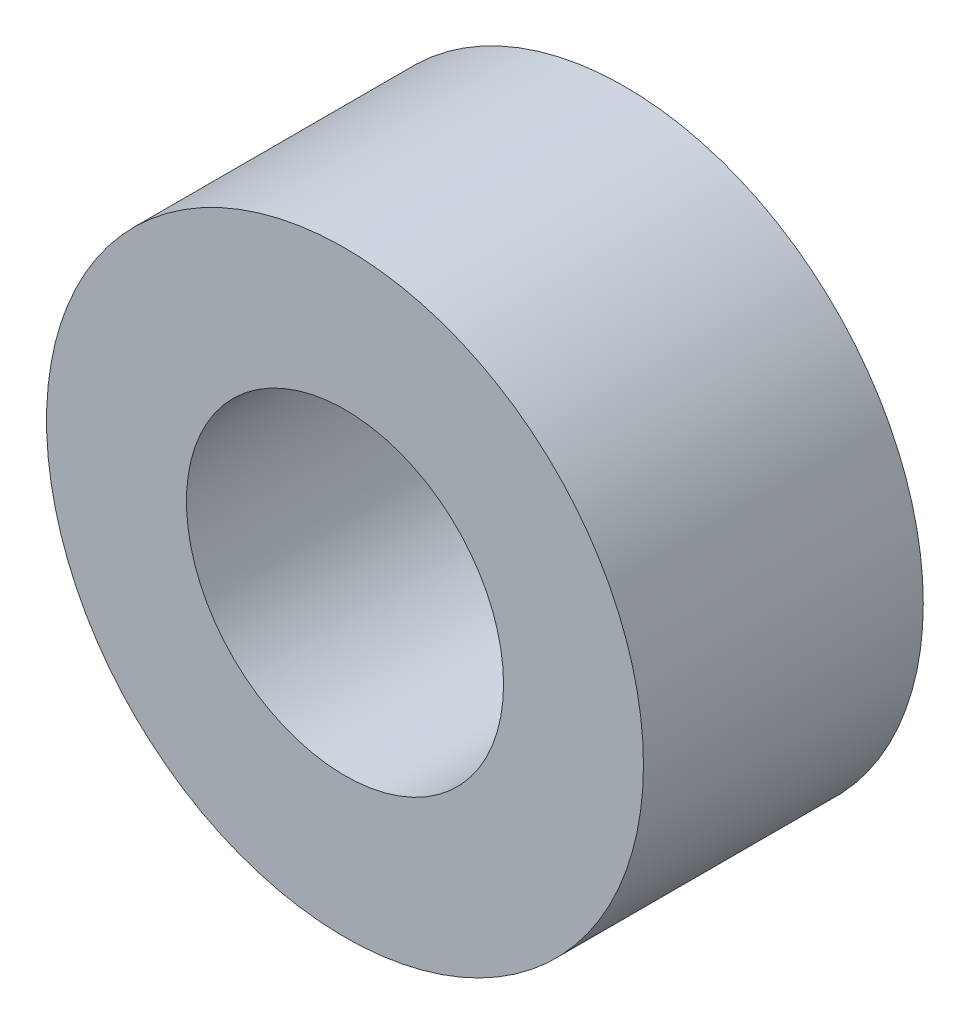
ISO-10303-21;
HEADER;
FILE_DESCRIPTION(('STEP AP214'),'2;1');
FILE_NAME('part.step','',(''),(''),'','','');
FILE_SCHEMA(('AUTOMOTIVE_DESIGN { 1 0 10303 214 1 1 1 1 }'));
ENDSEC;
DATA;
#1=APPLICATION_CONTEXT('core data for automotive mechanical design processes');
#2=APPLICATION_PROTOCOL_DEFINITION('international standard','automotive_design',2000,#1);
#3=PRODUCT_CONTEXT('',#1,'mechanical');
#4=PRODUCT('Part','Part','',(#3));
#5=PRODUCT_RELATED_PRODUCT_CATEGORY('part','',(#4));
#6=PRODUCT_DEFINITION_FORMATION('','',#4);
#7=PRODUCT_DEFINITION_CONTEXT('part definition',#1,'design');
#8=PRODUCT_DEFINITION('design','',#6,#7);
#9=PRODUCT_DEFINITION_SHAPE('','',#8);
#10=(LENGTH_UNIT() NAMED_UNIT(*) SI_UNIT(.MILLI.,.METRE.));
#11=(NAMED_UNIT(*) PLANE_ANGLE_UNIT() SI_UNIT($,.RADIAN.));
#12=(NAMED_UNIT(*) SI_UNIT($,.STERADIAN.) SOLID_ANGLE_UNIT());
#13=UNCERTAINTY_MEASURE_WITH_UNIT(LENGTH_MEASURE(1.E-05),#10,'distance_accuracy_value','');
#14=(GEOMETRIC_REPRESENTATION_CONTEXT(3) GLOBAL_UNCERTAINTY_ASSIGNED_CONTEXT((#13)) GLOBAL_UNIT_ASSIGNED_CONTEXT((#10,
#11,#12)) REPRESENTATION_CONTEXT('',''));
#15=CARTESIAN_POINT('',(0.,0.,0.));
#16=DIRECTION('',(0.,0.,1.));
#17=DIRECTION('',(1.,0.,0.));
#18=AXIS2_PLACEMENT_3D('',#15,#16,#17);
#19=CARTESIAN_POINT('',(-30.3019266469226,53.5999790383124,3.));
#20=DIRECTION('',(0.,0.,1.));
#21=DIRECTION('',(1.,0.,0.));
#22=AXIS2_PLACEMENT_3D('',#19,#20,#21);
#23=PLANE('',#22);
#24=CARTESIAN_POINT('',(-30.3019266469226,53.5999790383124,3.));
#25=DIRECTION('',(0.,0.,1.));
#26=DIRECTION('',(1.,0.,0.));
#27=AXIS2_PLACEMENT_3D('',#24,#25,#26);
#28=CIRCLE('',#27,3.2);
#29=CARTESIAN_POINT('',(-27.1019266469226,53.5999790383124,3.));
#30=VERTEX_POINT('',#29);
#31=EDGE_CURVE('E10',#30,#30,#28,.T.);
#32=ORIENTED_EDGE('',*,*,#31,.T.);
#33=EDGE_LOOP('',(#32));
#34=FACE_BOUND('',#33,.T.);
#35=CARTESIAN_POINT('',(-30.3019266469226,53.5999790383124,3.));
#36=DIRECTION('',(0.,0.,1.));
#37=DIRECTION('',(1.,0.,0.));
#38=AXIS2_PLACEMENT_3D('',#35,#36,#37);
#39=CIRCLE('',#38,1.7);
#40=CARTESIAN_POINT('',(-28.6019266469226,53.5999790383124,3.));
#41=VERTEX_POINT('',#40);
#42=EDGE_CURVE('E41',#41,#41,#39,.T.);
#43=ORIENTED_EDGE('',*,*,#42,.F.);
#44=EDGE_LOOP('',(#43));
#45=FACE_BOUND('',#44,.T.);
#46=ADVANCED_FACE('F30',(#34,#45),#23,.T.);
#47=CARTESIAN_POINT('',(-30.3019266469226,53.5999790383124,0.));
#48=DIRECTION('',(0.,0.,1.));
#49=DIRECTION('',(1.,0.,0.));
#50=AXIS2_PLACEMENT_3D('',#47,#48,#49);
#51=PLANE('',#50);
#52=CARTESIAN_POINT('',(-30.3019266469226,53.5999790383124,0.));
#53=DIRECTION('',(0.,0.,1.));
#54=DIRECTION('',(1.,0.,0.));
#55=AXIS2_PLACEMENT_3D('',#52,#53,#54);
#56=CIRCLE('',#55,3.2);
#57=CARTESIAN_POINT('',(-27.1019266469226,53.5999790383124,0.));
#58=VERTEX_POINT('',#57);
#59=EDGE_CURVE('E34',#58,#58,#56,.T.);
#60=ORIENTED_EDGE('',*,*,#59,.F.);
#61=EDGE_LOOP('',(#60));
#62=FACE_BOUND('',#61,.T.);
#63=CARTESIAN_POINT('',(-30.3019266469226,53.5999790383124,0.));
#64=DIRECTION('',(0.,0.,1.));
#65=DIRECTION('',(1.,0.,0.));
#66=AXIS2_PLACEMENT_3D('',#63,#64,#65);
#67=CIRCLE('',#66,1.7);
#68=CARTESIAN_POINT('',(-28.6019266469226,53.5999790383124,0.));
#69=VERTEX_POINT('',#68);
#70=EDGE_CURVE('E43',#69,#69,#67,.T.);
#71=ORIENTED_EDGE('',*,*,#70,.T.);
#72=EDGE_LOOP('',(#71));
#73=FACE_BOUND('',#72,.T.);
#74=ADVANCED_FACE('F53',(#62,#73),#51,.F.);
#75=CARTESIAN_POINT('',(-30.3019266469226,53.5999790383124,3.));
#76=DIRECTION('',(0.,0.,-1.));
#77=DIRECTION('',(-1.,0.,0.));
#78=AXIS2_PLACEMENT_3D('',#75,#76,#77);
#79=CYLINDRICAL_SURFACE('',#78,3.2);
#80=ORIENTED_EDGE('',*,*,#31,.F.);
#81=EDGE_LOOP('',(#80));
#82=FACE_BOUND('',#81,.T.);
#83=ORIENTED_EDGE('',*,*,#59,.T.);
#84=EDGE_LOOP('',(#83));
#85=FACE_BOUND('',#84,.T.);
#86=ADVANCED_FACE('F32',(#82,#85),#79,.T.);
#87=CARTESIAN_POINT('',(-30.3019266469226,53.5999790383124,3.));
#88=DIRECTION('',(0.,0.,-1.));
#89=DIRECTION('',(-1.,0.,0.));
#90=AXIS2_PLACEMENT_3D('',#87,#88,#89);
#91=CYLINDRICAL_SURFACE('',#90,1.7);
#92=ORIENTED_EDGE('',*,*,#42,.T.);
#93=EDGE_LOOP('',(#92));
#94=FACE_BOUND('',#93,.T.);
#95=ORIENTED_EDGE('',*,*,#70,.F.);
#96=EDGE_LOOP('',(#95));
#97=FACE_BOUND('',#96,.T.);
#98=ADVANCED_FACE('F49',(#94,#97),#91,.F.);
#99=CLOSED_SHELL('',(#46,#74,#86,#98));
#100=MANIFOLD_SOLID_BREP('B2',#99);
#101=ADVANCED_BREP_SHAPE_REPRESENTATION('',(#18,#100),#14);
#102=SHAPE_DEFINITION_REPRESENTATION(#9,#101);
ENDSEC;
END-ISO-10303-21;
